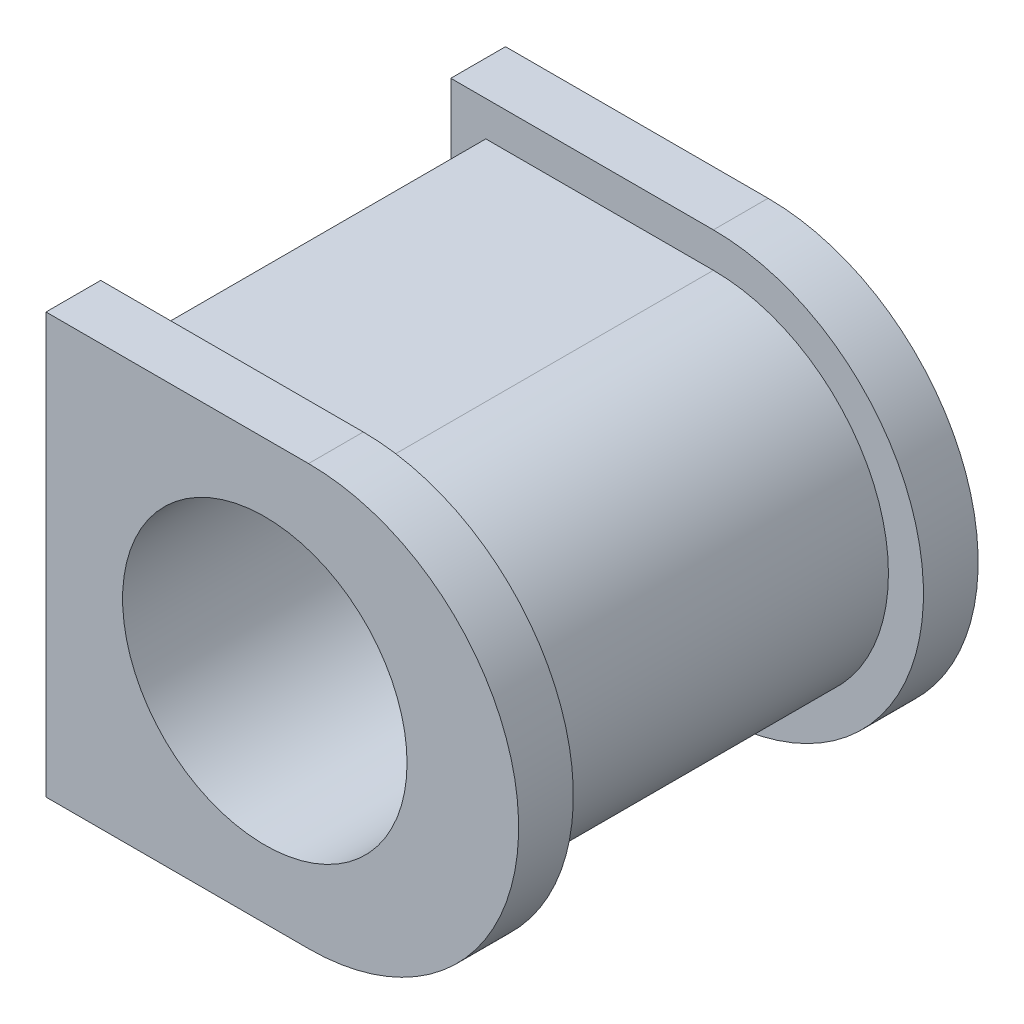
ISO-10303-21;
HEADER;
FILE_DESCRIPTION(('STEP AP214'),'2;1');
FILE_NAME('part.step','',(''),(''),'','','');
FILE_SCHEMA(('AUTOMOTIVE_DESIGN { 1 0 10303 214 1 1 1 1 }'));
ENDSEC;
DATA;
#1=APPLICATION_CONTEXT('core data for automotive mechanical design processes');
#2=APPLICATION_PROTOCOL_DEFINITION('international standard','automotive_design',2000,#1);
#3=PRODUCT_CONTEXT('',#1,'mechanical');
#4=PRODUCT('Part','Part','',(#3));
#5=PRODUCT_RELATED_PRODUCT_CATEGORY('part','',(#4));
#6=PRODUCT_DEFINITION_FORMATION('','',#4);
#7=PRODUCT_DEFINITION_CONTEXT('part definition',#1,'design');
#8=PRODUCT_DEFINITION('design','',#6,#7);
#9=PRODUCT_DEFINITION_SHAPE('','',#8);
#10=(LENGTH_UNIT() NAMED_UNIT(*) SI_UNIT(.MILLI.,.METRE.));
#11=(NAMED_UNIT(*) PLANE_ANGLE_UNIT() SI_UNIT($,.RADIAN.));
#12=(NAMED_UNIT(*) SI_UNIT($,.STERADIAN.) SOLID_ANGLE_UNIT());
#13=UNCERTAINTY_MEASURE_WITH_UNIT(LENGTH_MEASURE(1.E-05),#10,'distance_accuracy_value','');
#14=(GEOMETRIC_REPRESENTATION_CONTEXT(3) GLOBAL_UNCERTAINTY_ASSIGNED_CONTEXT((#13)) GLOBAL_UNIT_ASSIGNED_CONTEXT((#10,
#11,#12)) REPRESENTATION_CONTEXT('',''));
#15=CARTESIAN_POINT('',(0.,0.,0.));
#16=DIRECTION('',(0.,0.,1.));
#17=DIRECTION('',(1.,0.,0.));
#18=AXIS2_PLACEMENT_3D('',#15,#16,#17);
#19=CARTESIAN_POINT('',(0.,0.,12.5));
#20=DIRECTION('',(0.,0.,-1.));
#21=DIRECTION('',(-1.,0.,0.));
#22=AXIS2_PLACEMENT_3D('',#19,#20,#21);
#23=CYLINDRICAL_SURFACE('',#22,48.);
#24=CARTESIAN_POINT('',(0.,0.,0.));
#25=DIRECTION('',(0.,0.,1.));
#26=DIRECTION('',(1.,0.,0.));
#27=AXIS2_PLACEMENT_3D('',#24,#25,#26);
#28=CIRCLE('',#27,48.);
#29=CARTESIAN_POINT('',(0.,-48.,0.));
#30=VERTEX_POINT('',#29);
#31=CARTESIAN_POINT('',(0.,48.,0.));
#32=VERTEX_POINT('',#31);
#33=EDGE_CURVE('E217',#30,#32,#28,.T.);
#34=ORIENTED_EDGE('',*,*,#33,.T.);
#35=DIRECTION('',(0.,0.,-1.));
#36=VECTOR('',#35,1.);
#37=CARTESIAN_POINT('',(0.,48.,12.5));
#38=LINE('',#37,#36);
#39=CARTESIAN_POINT('',(0.,48.,12.5));
#40=VERTEX_POINT('',#39);
#41=EDGE_CURVE('E11',#40,#32,#38,.T.);
#42=ORIENTED_EDGE('',*,*,#41,.F.);
#43=CARTESIAN_POINT('',(0.,0.,12.5));
#44=DIRECTION('',(0.,0.,1.));
#45=DIRECTION('',(1.,0.,0.));
#46=AXIS2_PLACEMENT_3D('',#43,#44,#45);
#47=CIRCLE('',#46,48.);
#48=CARTESIAN_POINT('',(0.,-48.,12.5));
#49=VERTEX_POINT('',#48);
#50=EDGE_CURVE('E218',#49,#40,#47,.T.);
#51=ORIENTED_EDGE('',*,*,#50,.F.);
#52=DIRECTION('',(0.,0.,-1.));
#53=VECTOR('',#52,1.);
#54=CARTESIAN_POINT('',(0.,-48.,12.5));
#55=LINE('',#54,#53);
#56=EDGE_CURVE('E232',#49,#30,#55,.T.);
#57=ORIENTED_EDGE('',*,*,#56,.T.);
#58=EDGE_LOOP('',(#34,#42,#51,#57));
#59=FACE_BOUND('',#58,.T.);
#60=ADVANCED_FACE('F45',(#59),#23,.T.);
#61=CARTESIAN_POINT('',(0.,48.,12.5));
#62=DIRECTION('',(0.,-1.,0.));
#63=DIRECTION('',(1.,0.,0.));
#64=AXIS2_PLACEMENT_3D('',#61,#62,#63);
#65=PLANE('',#64);
#66=DIRECTION('',(-1.,0.,0.));
#67=VECTOR('',#66,1.);
#68=CARTESIAN_POINT('',(0.,48.,0.));
#69=LINE('',#68,#67);
#70=CARTESIAN_POINT('',(-60.,48.,0.));
#71=VERTEX_POINT('',#70);
#72=EDGE_CURVE('E236',#32,#71,#69,.T.);
#73=ORIENTED_EDGE('',*,*,#72,.T.);
#74=DIRECTION('',(0.,0.,-1.));
#75=VECTOR('',#74,1.);
#76=CARTESIAN_POINT('',(-60.,48.,12.5));
#77=LINE('',#76,#75);
#78=CARTESIAN_POINT('',(-60.,48.,12.5));
#79=VERTEX_POINT('',#78);
#80=EDGE_CURVE('E53',#79,#71,#77,.T.);
#81=ORIENTED_EDGE('',*,*,#80,.F.);
#82=DIRECTION('',(-1.,0.,0.));
#83=VECTOR('',#82,1.);
#84=CARTESIAN_POINT('',(0.,48.,12.5));
#85=LINE('',#84,#83);
#86=EDGE_CURVE('E222',#40,#79,#85,.T.);
#87=ORIENTED_EDGE('',*,*,#86,.F.);
#88=ORIENTED_EDGE('',*,*,#41,.T.);
#89=EDGE_LOOP('',(#73,#81,#87,#88));
#90=FACE_BOUND('',#89,.T.);
#91=ADVANCED_FACE('F272',(#90),#65,.F.);
#92=CARTESIAN_POINT('',(-60.,48.,12.5));
#93=DIRECTION('',(1.,0.,0.));
#94=DIRECTION('',(0.,0.,-1.));
#95=AXIS2_PLACEMENT_3D('',#92,#93,#94);
#96=PLANE('',#95);
#97=DIRECTION('',(0.,-1.,0.));
#98=VECTOR('',#97,1.);
#99=CARTESIAN_POINT('',(-60.,48.,0.));
#100=LINE('',#99,#98);
#101=CARTESIAN_POINT('',(-60.,-48.,0.));
#102=VERTEX_POINT('',#101);
#103=EDGE_CURVE('E239',#71,#102,#100,.T.);
#104=ORIENTED_EDGE('',*,*,#103,.T.);
#105=DIRECTION('',(0.,0.,-1.));
#106=VECTOR('',#105,1.);
#107=CARTESIAN_POINT('',(-60.,-48.,12.5));
#108=LINE('',#107,#106);
#109=CARTESIAN_POINT('',(-60.,-48.,12.5));
#110=VERTEX_POINT('',#109);
#111=EDGE_CURVE('E247',#110,#102,#108,.T.);
#112=ORIENTED_EDGE('',*,*,#111,.F.);
#113=DIRECTION('',(0.,-1.,0.));
#114=VECTOR('',#113,1.);
#115=CARTESIAN_POINT('',(-60.,48.,12.5));
#116=LINE('',#115,#114);
#117=EDGE_CURVE('E226',#79,#110,#116,.T.);
#118=ORIENTED_EDGE('',*,*,#117,.F.);
#119=ORIENTED_EDGE('',*,*,#80,.T.);
#120=EDGE_LOOP('',(#104,#112,#118,#119));
#121=FACE_BOUND('',#120,.T.);
#122=ADVANCED_FACE('F256',(#121),#96,.F.);
#123=CARTESIAN_POINT('',(-60.,-48.,12.5));
#124=DIRECTION('',(0.,1.,0.));
#125=DIRECTION('',(-1.,0.,0.));
#126=AXIS2_PLACEMENT_3D('',#123,#124,#125);
#127=PLANE('',#126);
#128=DIRECTION('',(1.,0.,0.));
#129=VECTOR('',#128,1.);
#130=CARTESIAN_POINT('',(-60.,-48.,0.));
#131=LINE('',#130,#129);
#132=EDGE_CURVE('E223',#102,#30,#131,.T.);
#133=ORIENTED_EDGE('',*,*,#132,.T.);
#134=ORIENTED_EDGE('',*,*,#56,.F.);
#135=DIRECTION('',(1.,0.,0.));
#136=VECTOR('',#135,1.);
#137=CARTESIAN_POINT('',(-60.,-48.,12.5));
#138=LINE('',#137,#136);
#139=EDGE_CURVE('E229',#110,#49,#138,.T.);
#140=ORIENTED_EDGE('',*,*,#139,.F.);
#141=ORIENTED_EDGE('',*,*,#111,.T.);
#142=EDGE_LOOP('',(#133,#134,#140,#141));
#143=FACE_BOUND('',#142,.T.);
#144=ADVANCED_FACE('F265',(#143),#127,.F.);
#145=CARTESIAN_POINT('',(0.,0.,12.5));
#146=DIRECTION('',(0.,0.,1.));
#147=DIRECTION('',(1.,0.,0.));
#148=AXIS2_PLACEMENT_3D('',#145,#146,#147);
#149=PLANE('',#148);
#150=CARTESIAN_POINT('',(0.,0.,12.5));
#151=DIRECTION('',(0.,0.,1.));
#152=DIRECTION('',(1.,0.,0.));
#153=AXIS2_PLACEMENT_3D('',#150,#151,#152);
#154=CIRCLE('',#153,40.);
#155=CARTESIAN_POINT('',(0.,-40.,12.5));
#156=VERTEX_POINT('',#155);
#157=CARTESIAN_POINT('',(0.,40.,12.5));
#158=VERTEX_POINT('',#157);
#159=EDGE_CURVE('E60',#156,#158,#154,.T.);
#160=ORIENTED_EDGE('',*,*,#159,.F.);
#161=DIRECTION('',(1.,0.,0.));
#162=VECTOR('',#161,1.);
#163=CARTESIAN_POINT('',(-52.,-40.,12.5));
#164=LINE('',#163,#162);
#165=CARTESIAN_POINT('',(-52.,-40.,12.5));
#166=VERTEX_POINT('',#165);
#167=EDGE_CURVE('E64',#166,#156,#164,.T.);
#168=ORIENTED_EDGE('',*,*,#167,.F.);
#169=DIRECTION('',(0.,-1.,0.));
#170=VECTOR('',#169,1.);
#171=CARTESIAN_POINT('',(-52.,40.,12.5));
#172=LINE('',#171,#170);
#173=CARTESIAN_POINT('',(-52.,40.,12.5));
#174=VERTEX_POINT('',#173);
#175=EDGE_CURVE('E197',#174,#166,#172,.T.);
#176=ORIENTED_EDGE('',*,*,#175,.F.);
#177=DIRECTION('',(-1.,0.,0.));
#178=VECTOR('',#177,1.);
#179=CARTESIAN_POINT('',(0.,40.,12.5));
#180=LINE('',#179,#178);
#181=EDGE_CURVE('E193',#158,#174,#180,.T.);
#182=ORIENTED_EDGE('',*,*,#181,.F.);
#183=EDGE_LOOP('',(#160,#168,#176,#182));
#184=FACE_BOUND('',#183,.T.);
#185=ORIENTED_EDGE('',*,*,#50,.T.);
#186=ORIENTED_EDGE('',*,*,#86,.T.);
#187=ORIENTED_EDGE('',*,*,#117,.T.);
#188=ORIENTED_EDGE('',*,*,#139,.T.);
#189=EDGE_LOOP('',(#185,#186,#187,#188));
#190=FACE_BOUND('',#189,.T.);
#191=ADVANCED_FACE('F271',(#184,#190),#149,.T.);
#192=CARTESIAN_POINT('',(0.,0.,0.));
#193=DIRECTION('',(0.,0.,1.));
#194=DIRECTION('',(1.,0.,0.));
#195=AXIS2_PLACEMENT_3D('',#192,#193,#194);
#196=PLANE('',#195);
#197=CARTESIAN_POINT('',(-9.99999999999999,0.,0.));
#198=DIRECTION('',(0.,0.,1.));
#199=DIRECTION('',(1.,0.,0.));
#200=AXIS2_PLACEMENT_3D('',#197,#198,#199);
#201=CIRCLE('',#200,32.5);
#202=CARTESIAN_POINT('',(22.5,0.,0.));
#203=VERTEX_POINT('',#202);
#204=EDGE_CURVE('E331',#203,#203,#201,.T.);
#205=ORIENTED_EDGE('',*,*,#204,.T.);
#206=EDGE_LOOP('',(#205));
#207=FACE_BOUND('',#206,.T.);
#208=ORIENTED_EDGE('',*,*,#33,.F.);
#209=ORIENTED_EDGE('',*,*,#132,.F.);
#210=ORIENTED_EDGE('',*,*,#103,.F.);
#211=ORIENTED_EDGE('',*,*,#72,.F.);
#212=EDGE_LOOP('',(#208,#209,#210,#211));
#213=FACE_BOUND('',#212,.T.);
#214=ADVANCED_FACE('F262',(#207,#213),#196,.F.);
#215=CARTESIAN_POINT('',(0.,0.,92.5));
#216=DIRECTION('',(0.,0.,-1.));
#217=DIRECTION('',(-1.,0.,0.));
#218=AXIS2_PLACEMENT_3D('',#215,#216,#217);
#219=CYLINDRICAL_SURFACE('',#218,40.);
#220=ORIENTED_EDGE('',*,*,#159,.T.);
#221=DIRECTION('',(0.,0.,-1.));
#222=VECTOR('',#221,1.);
#223=CARTESIAN_POINT('',(0.,40.,92.5));
#224=LINE('',#223,#222);
#225=CARTESIAN_POINT('',(0.,40.,92.5));
#226=VERTEX_POINT('',#225);
#227=EDGE_CURVE('E213',#226,#158,#224,.T.);
#228=ORIENTED_EDGE('',*,*,#227,.F.);
#229=CARTESIAN_POINT('',(0.,0.,92.5));
#230=DIRECTION('',(0.,0.,1.));
#231=DIRECTION('',(1.,0.,0.));
#232=AXIS2_PLACEMENT_3D('',#229,#230,#231);
#233=CIRCLE('',#232,40.);
#234=CARTESIAN_POINT('',(0.,-40.,92.5));
#235=VERTEX_POINT('',#234);
#236=EDGE_CURVE('E333',#235,#226,#233,.T.);
#237=ORIENTED_EDGE('',*,*,#236,.F.);
#238=DIRECTION('',(0.,0.,-1.));
#239=VECTOR('',#238,1.);
#240=CARTESIAN_POINT('',(0.,-40.,92.5));
#241=LINE('',#240,#239);
#242=EDGE_CURVE('E202',#235,#156,#241,.T.);
#243=ORIENTED_EDGE('',*,*,#242,.T.);
#244=EDGE_LOOP('',(#220,#228,#237,#243));
#245=FACE_BOUND('',#244,.T.);
#246=ADVANCED_FACE('F283',(#245),#219,.T.);
#247=CARTESIAN_POINT('',(0.,40.,92.5));
#248=DIRECTION('',(0.,-1.,0.));
#249=DIRECTION('',(0.,0.,-1.));
#250=AXIS2_PLACEMENT_3D('',#247,#248,#249);
#251=PLANE('',#250);
#252=ORIENTED_EDGE('',*,*,#181,.T.);
#253=DIRECTION('',(0.,0.,-1.));
#254=VECTOR('',#253,1.);
#255=CARTESIAN_POINT('',(-52.,40.,92.5));
#256=LINE('',#255,#254);
#257=CARTESIAN_POINT('',(-52.,40.,92.5));
#258=VERTEX_POINT('',#257);
#259=EDGE_CURVE('E209',#258,#174,#256,.T.);
#260=ORIENTED_EDGE('',*,*,#259,.F.);
#261=DIRECTION('',(-1.,0.,0.));
#262=VECTOR('',#261,1.);
#263=CARTESIAN_POINT('',(0.,40.,92.5));
#264=LINE('',#263,#262);
#265=EDGE_CURVE('E337',#226,#258,#264,.T.);
#266=ORIENTED_EDGE('',*,*,#265,.F.);
#267=ORIENTED_EDGE('',*,*,#227,.T.);
#268=EDGE_LOOP('',(#252,#260,#266,#267));
#269=FACE_BOUND('',#268,.T.);
#270=ADVANCED_FACE('F289',(#269),#251,.F.);
#271=CARTESIAN_POINT('',(-52.,40.,92.5));
#272=DIRECTION('',(1.,0.,0.));
#273=DIRECTION('',(0.,0.,-1.));
#274=AXIS2_PLACEMENT_3D('',#271,#272,#273);
#275=PLANE('',#274);
#276=ORIENTED_EDGE('',*,*,#175,.T.);
#277=DIRECTION('',(0.,0.,-1.));
#278=VECTOR('',#277,1.);
#279=CARTESIAN_POINT('',(-52.,-40.,92.5));
#280=LINE('',#279,#278);
#281=CARTESIAN_POINT('',(-52.,-40.,92.5));
#282=VERTEX_POINT('',#281);
#283=EDGE_CURVE('E206',#282,#166,#280,.T.);
#284=ORIENTED_EDGE('',*,*,#283,.F.);
#285=DIRECTION('',(0.,-1.,0.));
#286=VECTOR('',#285,1.);
#287=CARTESIAN_POINT('',(-52.,40.,92.5));
#288=LINE('',#287,#286);
#289=EDGE_CURVE('E344',#258,#282,#288,.T.);
#290=ORIENTED_EDGE('',*,*,#289,.F.);
#291=ORIENTED_EDGE('',*,*,#259,.T.);
#292=EDGE_LOOP('',(#276,#284,#290,#291));
#293=FACE_BOUND('',#292,.T.);
#294=ADVANCED_FACE('F293',(#293),#275,.F.);
#295=CARTESIAN_POINT('',(-52.,-40.,92.5));
#296=DIRECTION('',(0.,1.,0.));
#297=DIRECTION('',(0.,0.,1.));
#298=AXIS2_PLACEMENT_3D('',#295,#296,#297);
#299=PLANE('',#298);
#300=ORIENTED_EDGE('',*,*,#167,.T.);
#301=ORIENTED_EDGE('',*,*,#242,.F.);
#302=DIRECTION('',(1.,0.,0.));
#303=VECTOR('',#302,1.);
#304=CARTESIAN_POINT('',(-52.,-40.,92.5));
#305=LINE('',#304,#303);
#306=EDGE_CURVE('E168',#282,#235,#305,.T.);
#307=ORIENTED_EDGE('',*,*,#306,.F.);
#308=ORIENTED_EDGE('',*,*,#283,.T.);
#309=EDGE_LOOP('',(#300,#301,#307,#308));
#310=FACE_BOUND('',#309,.T.);
#311=ADVANCED_FACE('F297',(#310),#299,.F.);
#312=CARTESIAN_POINT('',(0.,0.,92.5));
#313=DIRECTION('',(0.,0.,1.));
#314=DIRECTION('',(-1.,0.,0.));
#315=AXIS2_PLACEMENT_3D('',#312,#313,#314);
#316=CYLINDRICAL_SURFACE('',#315,48.);
#317=CARTESIAN_POINT('',(0.,0.,105.));
#318=DIRECTION('',(0.,0.,1.));
#319=DIRECTION('',(1.,0.,0.));
#320=AXIS2_PLACEMENT_3D('',#317,#318,#319);
#321=CIRCLE('',#320,48.);
#322=CARTESIAN_POINT('',(0.,-48.,105.));
#323=VERTEX_POINT('',#322);
#324=CARTESIAN_POINT('',(0.,48.,105.));
#325=VERTEX_POINT('',#324);
#326=EDGE_CURVE('E176',#323,#325,#321,.T.);
#327=ORIENTED_EDGE('',*,*,#326,.F.);
#328=DIRECTION('',(0.,0.,1.));
#329=VECTOR('',#328,1.);
#330=CARTESIAN_POINT('',(0.,-48.,92.5));
#331=LINE('',#330,#329);
#332=CARTESIAN_POINT('',(0.,-48.,92.5));
#333=VERTEX_POINT('',#332);
#334=EDGE_CURVE('E158',#333,#323,#331,.T.);
#335=ORIENTED_EDGE('',*,*,#334,.F.);
#336=CARTESIAN_POINT('',(0.,0.,92.5));
#337=DIRECTION('',(0.,0.,1.));
#338=DIRECTION('',(1.,0.,0.));
#339=AXIS2_PLACEMENT_3D('',#336,#337,#338);
#340=CIRCLE('',#339,48.);
#341=CARTESIAN_POINT('',(0.,48.,92.5));
#342=VERTEX_POINT('',#341);
#343=EDGE_CURVE('E136',#333,#342,#340,.T.);
#344=ORIENTED_EDGE('',*,*,#343,.T.);
#345=DIRECTION('',(0.,0.,1.));
#346=VECTOR('',#345,1.);
#347=CARTESIAN_POINT('',(0.,48.,92.5));
#348=LINE('',#347,#346);
#349=EDGE_CURVE('E146',#342,#325,#348,.T.);
#350=ORIENTED_EDGE('',*,*,#349,.T.);
#351=EDGE_LOOP('',(#327,#335,#344,#350));
#352=FACE_BOUND('',#351,.T.);
#353=ADVANCED_FACE('F156',(#352),#316,.T.);
#354=CARTESIAN_POINT('',(0.,48.,92.5));
#355=DIRECTION('',(0.,-1.,0.));
#356=DIRECTION('',(1.,0.,0.));
#357=AXIS2_PLACEMENT_3D('',#354,#355,#356);
#358=PLANE('',#357);
#359=DIRECTION('',(-1.,0.,0.));
#360=VECTOR('',#359,1.);
#361=CARTESIAN_POINT('',(0.,48.,105.));
#362=LINE('',#361,#360);
#363=CARTESIAN_POINT('',(-60.,48.,105.));
#364=VERTEX_POINT('',#363);
#365=EDGE_CURVE('E149',#325,#364,#362,.T.);
#366=ORIENTED_EDGE('',*,*,#365,.F.);
#367=ORIENTED_EDGE('',*,*,#349,.F.);
#368=DIRECTION('',(-1.,0.,0.));
#369=VECTOR('',#368,1.);
#370=CARTESIAN_POINT('',(0.,48.,92.5));
#371=LINE('',#370,#369);
#372=CARTESIAN_POINT('',(-60.,48.,92.5));
#373=VERTEX_POINT('',#372);
#374=EDGE_CURVE('E132',#342,#373,#371,.T.);
#375=ORIENTED_EDGE('',*,*,#374,.T.);
#376=DIRECTION('',(0.,0.,1.));
#377=VECTOR('',#376,1.);
#378=CARTESIAN_POINT('',(-60.,48.,92.5));
#379=LINE('',#378,#377);
#380=EDGE_CURVE('E154',#373,#364,#379,.T.);
#381=ORIENTED_EDGE('',*,*,#380,.T.);
#382=EDGE_LOOP('',(#366,#367,#375,#381));
#383=FACE_BOUND('',#382,.T.);
#384=ADVANCED_FACE('F147',(#383),#358,.F.);
#385=CARTESIAN_POINT('',(-60.,48.,92.5));
#386=DIRECTION('',(1.,0.,0.));
#387=DIRECTION('',(0.,0.,1.));
#388=AXIS2_PLACEMENT_3D('',#385,#386,#387);
#389=PLANE('',#388);
#390=DIRECTION('',(0.,-1.,0.));
#391=VECTOR('',#390,1.);
#392=CARTESIAN_POINT('',(-60.,48.,105.));
#393=LINE('',#392,#391);
#394=CARTESIAN_POINT('',(-60.,-48.,105.));
#395=VERTEX_POINT('',#394);
#396=EDGE_CURVE('E165',#364,#395,#393,.T.);
#397=ORIENTED_EDGE('',*,*,#396,.F.);
#398=ORIENTED_EDGE('',*,*,#380,.F.);
#399=DIRECTION('',(0.,-1.,0.));
#400=VECTOR('',#399,1.);
#401=CARTESIAN_POINT('',(-60.,48.,92.5));
#402=LINE('',#401,#400);
#403=CARTESIAN_POINT('',(-60.,-48.,92.5));
#404=VERTEX_POINT('',#403);
#405=EDGE_CURVE('E139',#373,#404,#402,.T.);
#406=ORIENTED_EDGE('',*,*,#405,.T.);
#407=DIRECTION('',(0.,0.,1.));
#408=VECTOR('',#407,1.);
#409=CARTESIAN_POINT('',(-60.,-48.,92.5));
#410=LINE('',#409,#408);
#411=EDGE_CURVE('E185',#404,#395,#410,.T.);
#412=ORIENTED_EDGE('',*,*,#411,.T.);
#413=EDGE_LOOP('',(#397,#398,#406,#412));
#414=FACE_BOUND('',#413,.T.);
#415=ADVANCED_FACE('F306',(#414),#389,.F.);
#416=CARTESIAN_POINT('',(-60.,-48.,92.5));
#417=DIRECTION('',(0.,1.,0.));
#418=DIRECTION('',(-1.,0.,0.));
#419=AXIS2_PLACEMENT_3D('',#416,#417,#418);
#420=PLANE('',#419);
#421=DIRECTION('',(1.,0.,0.));
#422=VECTOR('',#421,1.);
#423=CARTESIAN_POINT('',(-60.,-48.,105.));
#424=LINE('',#423,#422);
#425=EDGE_CURVE('E160',#395,#323,#424,.T.);
#426=ORIENTED_EDGE('',*,*,#425,.F.);
#427=ORIENTED_EDGE('',*,*,#411,.F.);
#428=DIRECTION('',(1.,0.,0.));
#429=VECTOR('',#428,1.);
#430=CARTESIAN_POINT('',(-60.,-48.,92.5));
#431=LINE('',#430,#429);
#432=EDGE_CURVE('E173',#404,#333,#431,.T.);
#433=ORIENTED_EDGE('',*,*,#432,.T.);
#434=ORIENTED_EDGE('',*,*,#334,.T.);
#435=EDGE_LOOP('',(#426,#427,#433,#434));
#436=FACE_BOUND('',#435,.T.);
#437=ADVANCED_FACE('F309',(#436),#420,.F.);
#438=CARTESIAN_POINT('',(0.,0.,92.5));
#439=DIRECTION('',(0.,0.,-1.));
#440=DIRECTION('',(1.,0.,0.));
#441=AXIS2_PLACEMENT_3D('',#438,#439,#440);
#442=PLANE('',#441);
#443=ORIENTED_EDGE('',*,*,#236,.T.);
#444=ORIENTED_EDGE('',*,*,#265,.T.);
#445=ORIENTED_EDGE('',*,*,#289,.T.);
#446=ORIENTED_EDGE('',*,*,#306,.T.);
#447=EDGE_LOOP('',(#443,#444,#445,#446));
#448=FACE_BOUND('',#447,.T.);
#449=ORIENTED_EDGE('',*,*,#343,.F.);
#450=ORIENTED_EDGE('',*,*,#432,.F.);
#451=ORIENTED_EDGE('',*,*,#405,.F.);
#452=ORIENTED_EDGE('',*,*,#374,.F.);
#453=EDGE_LOOP('',(#449,#450,#451,#452));
#454=FACE_BOUND('',#453,.T.);
#455=ADVANCED_FACE('F134',(#448,#454),#442,.T.);
#456=CARTESIAN_POINT('',(0.,0.,105.));
#457=DIRECTION('',(0.,0.,-1.));
#458=DIRECTION('',(1.,0.,0.));
#459=AXIS2_PLACEMENT_3D('',#456,#457,#458);
#460=PLANE('',#459);
#461=CARTESIAN_POINT('',(-9.99999999999999,0.,105.));
#462=DIRECTION('',(0.,0.,1.));
#463=DIRECTION('',(1.,0.,0.));
#464=AXIS2_PLACEMENT_3D('',#461,#462,#463);
#465=CIRCLE('',#464,32.5);
#466=CARTESIAN_POINT('',(22.5,0.,105.));
#467=VERTEX_POINT('',#466);
#468=EDGE_CURVE('E328',#467,#467,#465,.T.);
#469=ORIENTED_EDGE('',*,*,#468,.F.);
#470=EDGE_LOOP('',(#469));
#471=FACE_BOUND('',#470,.T.);
#472=ORIENTED_EDGE('',*,*,#326,.T.);
#473=ORIENTED_EDGE('',*,*,#365,.T.);
#474=ORIENTED_EDGE('',*,*,#396,.T.);
#475=ORIENTED_EDGE('',*,*,#425,.T.);
#476=EDGE_LOOP('',(#472,#473,#474,#475));
#477=FACE_BOUND('',#476,.T.);
#478=ADVANCED_FACE('F314',(#471,#477),#460,.F.);
#479=CARTESIAN_POINT('',(-9.99999999999999,0.,-15.));
#480=DIRECTION('',(0.,0.,1.));
#481=DIRECTION('',(1.,0.,0.));
#482=AXIS2_PLACEMENT_3D('',#479,#480,#481);
#483=CYLINDRICAL_SURFACE('',#482,32.5);
#484=ORIENTED_EDGE('',*,*,#468,.T.);
#485=EDGE_LOOP('',(#484));
#486=FACE_BOUND('',#485,.T.);
#487=ORIENTED_EDGE('',*,*,#204,.F.);
#488=EDGE_LOOP('',(#487));
#489=FACE_BOUND('',#488,.T.);
#490=ADVANCED_FACE('F317',(#486,#489),#483,.F.);
#491=CLOSED_SHELL('',(#60,#91,#122,#144,#191,#214,#246,#270,#294,#311,#353,#384,#415,#437,#455,
#478,#490));
#492=MANIFOLD_SOLID_BREP('B2',#491);
#493=ADVANCED_BREP_SHAPE_REPRESENTATION('',(#18,#492),#14);
#494=SHAPE_DEFINITION_REPRESENTATION(#9,#493);
ENDSEC;
END-ISO-10303-21;
